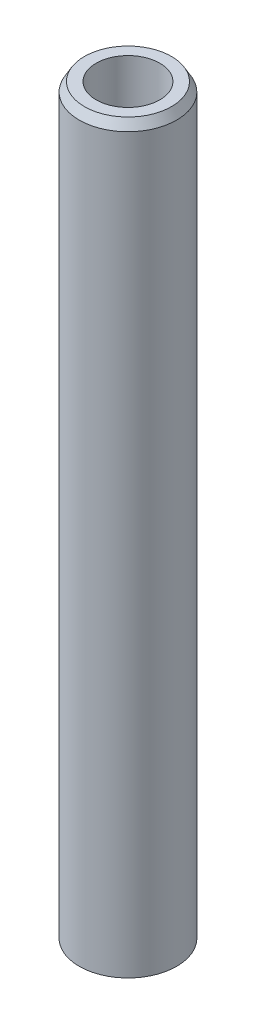
ISO-10303-21;
HEADER;
FILE_DESCRIPTION(('STEP AP214'),'2;1');
FILE_NAME('part.step','',(''),(''),'','','');
FILE_SCHEMA(('AUTOMOTIVE_DESIGN { 1 0 10303 214 1 1 1 1 }'));
ENDSEC;
DATA;
#1=APPLICATION_CONTEXT('core data for automotive mechanical design processes');
#2=APPLICATION_PROTOCOL_DEFINITION('international standard','automotive_design',2000,#1);
#3=PRODUCT_CONTEXT('',#1,'mechanical');
#4=PRODUCT('Part','Part','',(#3));
#5=PRODUCT_RELATED_PRODUCT_CATEGORY('part','',(#4));
#6=PRODUCT_DEFINITION_FORMATION('','',#4);
#7=PRODUCT_DEFINITION_CONTEXT('part definition',#1,'design');
#8=PRODUCT_DEFINITION('design','',#6,#7);
#9=PRODUCT_DEFINITION_SHAPE('','',#8);
#10=(LENGTH_UNIT() NAMED_UNIT(*) SI_UNIT(.MILLI.,.METRE.));
#11=(NAMED_UNIT(*) PLANE_ANGLE_UNIT() SI_UNIT($,.RADIAN.));
#12=(NAMED_UNIT(*) SI_UNIT($,.STERADIAN.) SOLID_ANGLE_UNIT());
#13=UNCERTAINTY_MEASURE_WITH_UNIT(LENGTH_MEASURE(1.E-05),#10,'distance_accuracy_value','');
#14=(GEOMETRIC_REPRESENTATION_CONTEXT(3) GLOBAL_UNCERTAINTY_ASSIGNED_CONTEXT((#13)) GLOBAL_UNIT_ASSIGNED_CONTEXT((#10,
#11,#12)) REPRESENTATION_CONTEXT('',''));
#15=CARTESIAN_POINT('',(0.,0.,0.));
#16=DIRECTION('',(0.,0.,1.));
#17=DIRECTION('',(1.,0.,0.));
#18=AXIS2_PLACEMENT_3D('',#15,#16,#17);
#19=CARTESIAN_POINT('',(0.,268.285741236992,0.));
#20=DIRECTION('',(0.,-1.,0.));
#21=DIRECTION('',(0.,0.,-1.));
#22=AXIS2_PLACEMENT_3D('',#19,#20,#21);
#23=CYLINDRICAL_SURFACE('',#22,17.5);
#24=CARTESIAN_POINT('',(0.,265.037882477056,0.));
#25=DIRECTION('',(0.,1.,0.));
#26=DIRECTION('',(0.,0.,1.));
#27=AXIS2_PLACEMENT_3D('',#24,#25,#26);
#28=CIRCLE('',#27,17.5);
#29=CARTESIAN_POINT('',(0.,265.037882477056,17.5));
#30=VERTEX_POINT('',#29);
#31=EDGE_CURVE('E50',#30,#30,#28,.F.);
#32=ORIENTED_EDGE('',*,*,#31,.T.);
#33=EDGE_LOOP('',(#32));
#34=FACE_BOUND('',#33,.T.);
#35=CARTESIAN_POINT('',(0.,1.87515212933925,0.));
#36=DIRECTION('',(0.,1.,0.));
#37=DIRECTION('',(0.,0.,1.));
#38=AXIS2_PLACEMENT_3D('',#35,#36,#37);
#39=CIRCLE('',#38,17.5);
#40=CARTESIAN_POINT('',(0.,1.87515212933925,17.5));
#41=VERTEX_POINT('',#40);
#42=EDGE_CURVE('E51',#41,#41,#39,.T.);
#43=ORIENTED_EDGE('',*,*,#42,.T.);
#44=EDGE_LOOP('',(#43));
#45=FACE_BOUND('',#44,.T.);
#46=ADVANCED_FACE('F39',(#34,#45),#23,.T.);
#47=CARTESIAN_POINT('',(0.,268.285741236992,0.));
#48=DIRECTION('',(0.,1.,0.));
#49=DIRECTION('',(0.,0.,1.));
#50=AXIS2_PLACEMENT_3D('',#47,#48,#49);
#51=PLANE('',#50);
#52=CARTESIAN_POINT('',(0.,268.285741236992,0.));
#53=DIRECTION('',(0.,1.,0.));
#54=DIRECTION('',(0.,0.,1.));
#55=AXIS2_PLACEMENT_3D('',#52,#53,#54);
#56=CIRCLE('',#55,15.6248478706607);
#57=CARTESIAN_POINT('',(0.,268.285741236992,15.6248478706607));
#58=VERTEX_POINT('',#57);
#59=EDGE_CURVE('E54',#58,#58,#56,.T.);
#60=ORIENTED_EDGE('',*,*,#59,.T.);
#61=EDGE_LOOP('',(#60));
#62=FACE_BOUND('',#61,.T.);
#63=CARTESIAN_POINT('',(0.,268.285741236992,0.));
#64=DIRECTION('',(0.,1.,0.));
#65=DIRECTION('',(0.,0.,1.));
#66=AXIS2_PLACEMENT_3D('',#63,#64,#65);
#67=CIRCLE('',#66,11.4236482859905);
#68=CARTESIAN_POINT('',(0.,268.285741236992,11.4236482859905));
#69=VERTEX_POINT('',#68);
#70=EDGE_CURVE('E58',#69,#69,#67,.T.);
#71=ORIENTED_EDGE('',*,*,#70,.F.);
#72=EDGE_LOOP('',(#71));
#73=FACE_BOUND('',#72,.T.);
#74=ADVANCED_FACE('F69',(#62,#73),#51,.T.);
#75=CARTESIAN_POINT('',(0.,0.,0.));
#76=DIRECTION('',(0.,1.,0.));
#77=DIRECTION('',(0.,0.,1.));
#78=AXIS2_PLACEMENT_3D('',#75,#76,#77);
#79=PLANE('',#78);
#80=CARTESIAN_POINT('',(0.,0.,0.));
#81=DIRECTION('',(0.,1.,0.));
#82=DIRECTION('',(0.,0.,1.));
#83=AXIS2_PLACEMENT_3D('',#80,#81,#82);
#84=CIRCLE('',#83,14.2521412400634);
#85=CARTESIAN_POINT('',(0.,0.,14.2521412400634));
#86=VERTEX_POINT('',#85);
#87=EDGE_CURVE('E10',#86,#86,#84,.F.);
#88=ORIENTED_EDGE('',*,*,#87,.T.);
#89=EDGE_LOOP('',(#88));
#90=FACE_BOUND('',#89,.T.);
#91=CARTESIAN_POINT('',(0.,0.,0.));
#92=DIRECTION('',(0.,1.,0.));
#93=DIRECTION('',(0.,0.,1.));
#94=AXIS2_PLACEMENT_3D('',#91,#92,#93);
#95=CIRCLE('',#94,11.4236482859905);
#96=CARTESIAN_POINT('',(0.,0.,11.4236482859905));
#97=VERTEX_POINT('',#96);
#98=EDGE_CURVE('E63',#97,#97,#95,.T.);
#99=ORIENTED_EDGE('',*,*,#98,.T.);
#100=EDGE_LOOP('',(#99));
#101=FACE_BOUND('',#100,.T.);
#102=ADVANCED_FACE('F75',(#90,#101),#79,.F.);
#103=CARTESIAN_POINT('',(0.,268.285741236992,0.));
#104=DIRECTION('',(0.,-1.,0.));
#105=DIRECTION('',(0.,0.,-1.));
#106=AXIS2_PLACEMENT_3D('',#103,#104,#105);
#107=CYLINDRICAL_SURFACE('',#106,11.4236482859905);
#108=ORIENTED_EDGE('',*,*,#70,.T.);
#109=EDGE_LOOP('',(#108));
#110=FACE_BOUND('',#109,.T.);
#111=ORIENTED_EDGE('',*,*,#98,.F.);
#112=EDGE_LOOP('',(#111));
#113=FACE_BOUND('',#112,.T.);
#114=ADVANCED_FACE('F70',(#110,#113),#107,.F.);
#115=CARTESIAN_POINT('',(0.,268.285741236992,0.));
#116=DIRECTION('',(0.,-1.,0.));
#117=DIRECTION('',(0.,0.,-1.));
#118=AXIS2_PLACEMENT_3D('',#115,#116,#117);
#119=CONICAL_SURFACE('',#118,15.6248478706607,0.523598775598295);
#120=ORIENTED_EDGE('',*,*,#31,.F.);
#121=EDGE_LOOP('',(#120));
#122=FACE_BOUND('',#121,.T.);
#123=ORIENTED_EDGE('',*,*,#59,.F.);
#124=EDGE_LOOP('',(#123));
#125=FACE_BOUND('',#124,.T.);
#126=ADVANCED_FACE('F81',(#122,#125),#119,.T.);
#127=CARTESIAN_POINT('',(0.,1.87515212933925,0.));
#128=DIRECTION('',(0.,1.,0.));
#129=DIRECTION('',(0.,0.,1.));
#130=AXIS2_PLACEMENT_3D('',#127,#128,#129);
#131=CONICAL_SURFACE('',#130,17.5,1.0471975511966);
#132=CARTESIAN_POINT('',(0.,0.,14.2521412400634));
#133=CARTESIAN_POINT('',(0.,0.0195328346806173,14.2859731021461));
#134=CARTESIAN_POINT('',(0.,0.0390656693612344,14.3198049642288));
#135=CARTESIAN_POINT('',(0.,0.0781313387224687,14.3874686883941));
#136=CARTESIAN_POINT('',(0.,0.0976641734030859,14.4213005504768));
#137=CARTESIAN_POINT('',(0.,0.13672984276432,14.4889642746421));
#138=CARTESIAN_POINT('',(0.,0.156262677444938,14.5227961367248));
#139=CARTESIAN_POINT('',(0.,0.195328346806172,14.5904598608901));
#140=CARTESIAN_POINT('',(0.,0.214861181486789,14.6242917229728));
#141=CARTESIAN_POINT('',(0.,0.253926850848023,14.6919554471382));
#142=CARTESIAN_POINT('',(0.,0.273459685528641,14.7257873092208));
#143=CARTESIAN_POINT('',(0.,0.312525354889875,14.7934510333862));
#144=CARTESIAN_POINT('',(0.,0.332058189570492,14.8272828954688));
#145=CARTESIAN_POINT('',(0.,0.371123858931727,14.8949466196342));
#146=CARTESIAN_POINT('',(0.,0.390656693612344,14.9287784817169));
#147=CARTESIAN_POINT('',(0.,0.429722362973579,14.9964422058822));
#148=CARTESIAN_POINT('',(0.,0.449255197654196,15.0302740679649));
#149=CARTESIAN_POINT('',(0.,0.48832086701543,15.0979377921302));
#150=CARTESIAN_POINT('',(0.,0.507853701696047,15.1317696542129));
#151=CARTESIAN_POINT('',(0.,0.546919371057282,15.1994333783782));
#152=CARTESIAN_POINT('',(0.,0.566452205737899,15.2332652404609));
#153=CARTESIAN_POINT('',(0.,0.605517875099133,15.3009289646263));
#154=CARTESIAN_POINT('',(0.,0.62505070977975,15.3347608267089));
#155=CARTESIAN_POINT('',(0.,0.664116379140985,15.4024245508743));
#156=CARTESIAN_POINT('',(0.,0.683649213821602,15.436256412957));
#157=CARTESIAN_POINT('',(0.,0.722714883182837,15.5039201371223));
#158=CARTESIAN_POINT('',(0.,0.742247717863454,15.537751999205));
#159=CARTESIAN_POINT('',(0.,0.781313387224688,15.6054157233703));
#160=CARTESIAN_POINT('',(0.,0.800846221905306,15.639247585453));
#161=CARTESIAN_POINT('',(0.,0.83991189126654,15.7069113096183));
#162=CARTESIAN_POINT('',(0.,0.859444725947157,15.740743171701));
#163=CARTESIAN_POINT('',(0.,0.898510395308391,15.8084068958664));
#164=CARTESIAN_POINT('',(0.,0.918043229989009,15.842238757949));
#165=CARTESIAN_POINT('',(0.,0.957108899350243,15.9099024821144));
#166=CARTESIAN_POINT('',(0.,0.976641734030861,15.9437343441971));
#167=CARTESIAN_POINT('',(0.,1.0157074033921,16.0113980683624));
#168=CARTESIAN_POINT('',(0.,1.03524023807271,16.0452299304451));
#169=CARTESIAN_POINT('',(0.,1.07430590743395,16.1128936546104));
#170=CARTESIAN_POINT('',(0.,1.09383874211456,16.1467255166931));
#171=CARTESIAN_POINT('',(0.,1.1329044114758,16.2143892408584));
#172=CARTESIAN_POINT('',(0.,1.15243724615642,16.2482211029411));
#173=CARTESIAN_POINT('',(0.,1.19150291551765,16.3158848271065));
#174=CARTESIAN_POINT('',(0.,1.21103575019827,16.3497166891891));
#175=CARTESIAN_POINT('',(0.,1.2501014195595,16.4173804133545));
#176=CARTESIAN_POINT('',(0.,1.26963425424012,16.4512122754371));
#177=CARTESIAN_POINT('',(0.,1.30869992360135,16.5188759996025));
#178=CARTESIAN_POINT('',(0.,1.32823275828197,16.5527078616852));
#179=CARTESIAN_POINT('',(0.,1.3672984276432,16.6203715858505));
#180=CARTESIAN_POINT('',(0.,1.38683126232382,16.6542034479332));
#181=CARTESIAN_POINT('',(0.,1.42589693168506,16.7218671720985));
#182=CARTESIAN_POINT('',(0.,1.44542976636567,16.7556990341812));
#183=CARTESIAN_POINT('',(0.,1.48449543572691,16.8233627583465));
#184=CARTESIAN_POINT('',(0.,1.50402827040753,16.8571946204292));
#185=CARTESIAN_POINT('',(0.,1.54309393976876,16.9248583445946));
#186=CARTESIAN_POINT('',(0.,1.56262677444938,16.9586902066772));
#187=CARTESIAN_POINT('',(0.,1.60169244381061,17.0263539308426));
#188=CARTESIAN_POINT('',(0.,1.62122527849123,17.0601857929253));
#189=CARTESIAN_POINT('',(0.,1.66029094785246,17.1278495170906));
#190=CARTESIAN_POINT('',(0.,1.67982378253308,17.1616813791733));
#191=CARTESIAN_POINT('',(0.,1.71888945189431,17.2293451033386));
#192=CARTESIAN_POINT('',(0.,1.73842228657493,17.2631769654213));
#193=CARTESIAN_POINT('',(0.,1.77748795593617,17.3308406895866));
#194=CARTESIAN_POINT('',(0.,1.79702079061678,17.3646725516693));
#195=CARTESIAN_POINT('',(0.,1.83608645997802,17.4323362758347));
#196=CARTESIAN_POINT('',(0.,1.85561929465864,17.4661681379173));
#197=CARTESIAN_POINT('',(0.,1.87515212933925,17.5));
#198=B_SPLINE_CURVE_WITH_KNOTS('',3,(#132,#133,#134,#135,#136,#137,#138,#139,#140,#141,#142,
#143,#144,#145,#146,#147,#148,#149,#150,#151,#152,#153,#154,#155,#156,#157,#158,#159,#160,#161,
#162,#163,#164,#165,#166,#167,#168,#169,#170,#171,#172,#173,#174,#175,#176,#177,#178,#179,#180,
#181,#182,#183,#184,#185,#186,#187,#188,#189,#190,#191,#192,#193,#194,#195,#196,#197),
.UNSPECIFIED.,.F.,.F.,(4,2,2,2,2,2,2,2,2,2,2,2,2,2,2,2,2,2,2,2,2,2,2,2,2,2,2,2,2,2,2,2,4),(0.,
0.117197008083703,0.234394016167408,0.351591024251113,0.468788032334817,0.585985040418521,
0.703182048502225,0.82037905658593,0.937576064669635,1.05477307275334,1.17197008083704,
1.28916708892075,1.40636409700445,1.52356110508816,1.64075811317186,1.75795512125557,
1.87515212933927,1.99234913742297,2.10954614550668,2.22674315359038,2.34394016167409,
2.46113716975779,2.5783341778415,2.6955311859252,2.81272819400891,2.92992520209261,
3.04712221017631,3.16431921826002,3.28151622634372,3.39871323442743,3.51591024251113,
3.63310725059484,3.75030425867854),.UNSPECIFIED.);
#199=EDGE_CURVE('BSEAM45',#86,#41,#198,.T.);
#200=ORIENTED_EDGE('',*,*,#87,.F.);
#201=ORIENTED_EDGE('',*,*,#42,.F.);
#202=ORIENTED_EDGE('',*,*,#199,.T.);
#203=ORIENTED_EDGE('',*,*,#199,.F.);
#204=EDGE_LOOP('',(#200,#202,#201,#203));
#205=FACE_BOUND('',#204,.T.);
#206=ADVANCED_FACE('F45',(#205),#131,.T.);
#207=CLOSED_SHELL('',(#46,#74,#102,#114,#126,#206));
#208=MANIFOLD_SOLID_BREP('B2',#207);
#209=ADVANCED_BREP_SHAPE_REPRESENTATION('',(#18,#208),#14);
#210=SHAPE_DEFINITION_REPRESENTATION(#9,#209);
ENDSEC;
END-ISO-10303-21;
